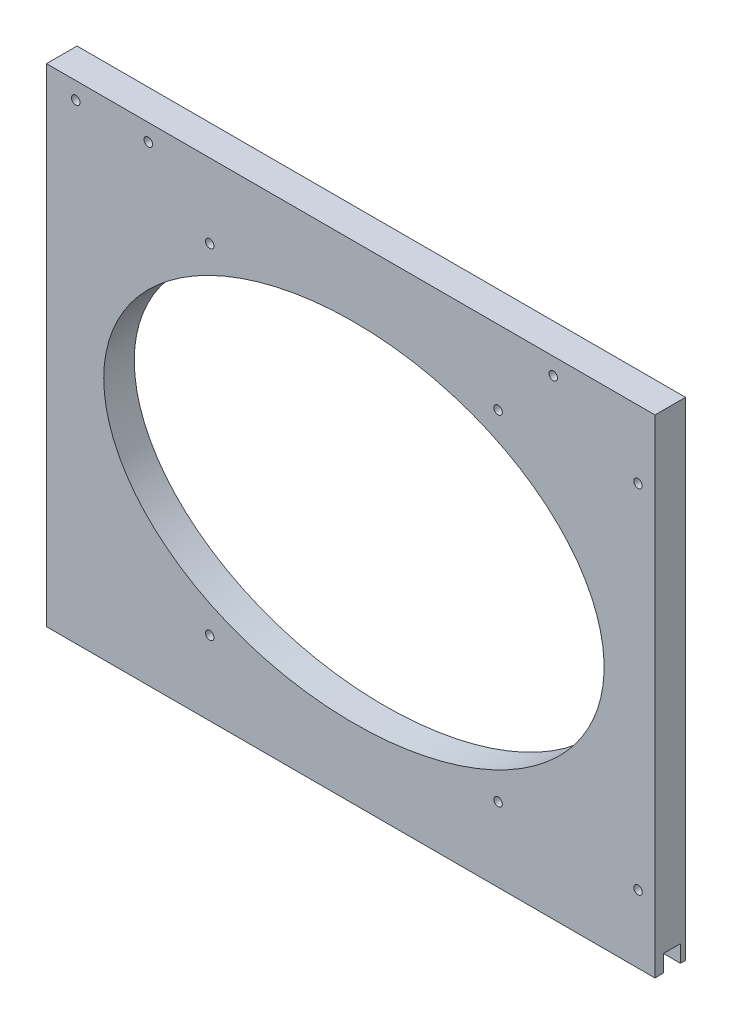
ISO-10303-21;
HEADER;
FILE_DESCRIPTION(('STEP AP214'),'2;1');
FILE_NAME('part.step','',(''),(''),'','','');
FILE_SCHEMA(('AUTOMOTIVE_DESIGN { 1 0 10303 214 1 1 1 1 }'));
ENDSEC;
DATA;
#1=APPLICATION_CONTEXT('core data for automotive mechanical design processes');
#2=APPLICATION_PROTOCOL_DEFINITION('international standard','automotive_design',2000,#1);
#3=PRODUCT_CONTEXT('',#1,'mechanical');
#4=PRODUCT('Part','Part','',(#3));
#5=PRODUCT_RELATED_PRODUCT_CATEGORY('part','',(#4));
#6=PRODUCT_DEFINITION_FORMATION('','',#4);
#7=PRODUCT_DEFINITION_CONTEXT('part definition',#1,'design');
#8=PRODUCT_DEFINITION('design','',#6,#7);
#9=PRODUCT_DEFINITION_SHAPE('','',#8);
#10=(LENGTH_UNIT() NAMED_UNIT(*) SI_UNIT(.MILLI.,.METRE.));
#11=(NAMED_UNIT(*) PLANE_ANGLE_UNIT() SI_UNIT($,.RADIAN.));
#12=(NAMED_UNIT(*) SI_UNIT($,.STERADIAN.) SOLID_ANGLE_UNIT());
#13=UNCERTAINTY_MEASURE_WITH_UNIT(LENGTH_MEASURE(1.E-05),#10,'distance_accuracy_value','');
#14=(GEOMETRIC_REPRESENTATION_CONTEXT(3) GLOBAL_UNCERTAINTY_ASSIGNED_CONTEXT((#13)) GLOBAL_UNIT_ASSIGNED_CONTEXT((#10,
#11,#12)) REPRESENTATION_CONTEXT('',''));
#15=CARTESIAN_POINT('',(0.,0.,0.));
#16=DIRECTION('',(0.,0.,1.));
#17=DIRECTION('',(1.,0.,0.));
#18=AXIS2_PLACEMENT_3D('',#15,#16,#17);
#19=CARTESIAN_POINT('',(-5258.59375,998.5375,-11.43));
#20=DIRECTION('',(0.,-1.,0.));
#21=DIRECTION('',(0.,0.,-1.));
#22=AXIS2_PLACEMENT_3D('',#19,#20,#21);
#23=PLANE('',#22);
#24=DIRECTION('',(1.,0.,0.));
#25=VECTOR('',#24,1.);
#26=CARTESIAN_POINT('',(-5495.38025612107,998.5375,-9.525));
#27=LINE('',#26,#25);
#28=CARTESIAN_POINT('',(-5486.4,998.5375,-9.525));
#29=VERTEX_POINT('',#28);
#30=CARTESIAN_POINT('',(-5258.59375,998.5375,-9.525));
#31=VERTEX_POINT('',#30);
#32=EDGE_CURVE('E134',#29,#31,#27,.T.);
#33=ORIENTED_EDGE('',*,*,#32,.F.);
#34=DIRECTION('',(0.,0.,1.));
#35=VECTOR('',#34,1.);
#36=CARTESIAN_POINT('',(-5486.4,998.5375,-11.43));
#37=LINE('',#36,#35);
#38=CARTESIAN_POINT('',(-5486.4,998.5375,-11.43));
#39=VERTEX_POINT('',#38);
#40=EDGE_CURVE('E123',#39,#29,#37,.T.);
#41=ORIENTED_EDGE('',*,*,#40,.F.);
#42=DIRECTION('',(1.,0.,0.));
#43=VECTOR('',#42,1.);
#44=CARTESIAN_POINT('',(-5258.59375,998.5375,-11.43));
#45=LINE('',#44,#43);
#46=CARTESIAN_POINT('',(-5258.59375,998.5375,-11.43));
#47=VERTEX_POINT('',#46);
#48=EDGE_CURVE('E264',#39,#47,#45,.T.);
#49=ORIENTED_EDGE('',*,*,#48,.T.);
#50=DIRECTION('',(0.,0.,1.));
#51=VECTOR('',#50,1.);
#52=CARTESIAN_POINT('',(-5258.59375,998.5375,-11.43));
#53=LINE('',#52,#51);
#54=EDGE_CURVE('E40',#47,#31,#53,.T.);
#55=ORIENTED_EDGE('',*,*,#54,.T.);
#56=EDGE_LOOP('',(#33,#41,#49,#55));
#57=FACE_BOUND('',#56,.T.);
#58=ADVANCED_FACE('F31',(#57),#23,.T.);
#59=CARTESIAN_POINT('',(-5486.4,1181.1,-11.43));
#60=DIRECTION('',(0.,1.,0.));
#61=DIRECTION('',(0.,0.,1.));
#62=AXIS2_PLACEMENT_3D('',#59,#60,#61);
#63=PLANE('',#62);
#64=DIRECTION('',(-1.,0.,0.));
#65=VECTOR('',#64,1.);
#66=CARTESIAN_POINT('',(-5486.4,1181.1,0.));
#67=LINE('',#66,#65);
#68=CARTESIAN_POINT('',(-5258.59375,1181.1,0.));
#69=VERTEX_POINT('',#68);
#70=CARTESIAN_POINT('',(-5486.4,1181.1,0.));
#71=VERTEX_POINT('',#70);
#72=EDGE_CURVE('E191',#69,#71,#67,.T.);
#73=ORIENTED_EDGE('',*,*,#72,.F.);
#74=DIRECTION('',(0.,0.,1.));
#75=VECTOR('',#74,1.);
#76=CARTESIAN_POINT('',(-5258.59375,1181.1,-11.43));
#77=LINE('',#76,#75);
#78=CARTESIAN_POINT('',(-5258.59375,1181.1,-11.43));
#79=VERTEX_POINT('',#78);
#80=EDGE_CURVE('E11',#79,#69,#77,.T.);
#81=ORIENTED_EDGE('',*,*,#80,.F.);
#82=DIRECTION('',(-1.,0.,0.));
#83=VECTOR('',#82,1.);
#84=CARTESIAN_POINT('',(-5486.4,1181.1,-11.43));
#85=LINE('',#84,#83);
#86=CARTESIAN_POINT('',(-5486.4,1181.1,-11.43));
#87=VERTEX_POINT('',#86);
#88=EDGE_CURVE('E194',#79,#87,#85,.T.);
#89=ORIENTED_EDGE('',*,*,#88,.T.);
#90=DIRECTION('',(0.,0.,1.));
#91=VECTOR('',#90,1.);
#92=CARTESIAN_POINT('',(-5486.4,1181.1,-11.43));
#93=LINE('',#92,#91);
#94=EDGE_CURVE('E35',#87,#71,#93,.T.);
#95=ORIENTED_EDGE('',*,*,#94,.T.);
#96=EDGE_LOOP('',(#73,#81,#89,#95));
#97=FACE_BOUND('',#96,.T.);
#98=ADVANCED_FACE('F33',(#97),#63,.T.);
#99=CARTESIAN_POINT('',(-5258.59375,1181.1,-11.43));
#100=DIRECTION('',(1.,0.,0.));
#101=DIRECTION('',(0.,0.,-1.));
#102=AXIS2_PLACEMENT_3D('',#99,#100,#101);
#103=PLANE('',#102);
#104=DIRECTION('',(0.,1.,0.));
#105=VECTOR('',#104,1.);
#106=CARTESIAN_POINT('',(-5258.59375,1004.8875,-9.525));
#107=LINE('',#106,#105);
#108=CARTESIAN_POINT('',(-5258.59375,1004.8875,-9.525));
#109=VERTEX_POINT('',#108);
#110=EDGE_CURVE('E118',#31,#109,#107,.T.);
#111=ORIENTED_EDGE('',*,*,#110,.F.);
#112=ORIENTED_EDGE('',*,*,#54,.F.);
#113=DIRECTION('',(0.,1.,0.));
#114=VECTOR('',#113,1.);
#115=CARTESIAN_POINT('',(-5258.59375,1181.1,-11.43));
#116=LINE('',#115,#114);
#117=EDGE_CURVE('E261',#47,#79,#116,.T.);
#118=ORIENTED_EDGE('',*,*,#117,.T.);
#119=ORIENTED_EDGE('',*,*,#80,.T.);
#120=DIRECTION('',(0.,1.,0.));
#121=VECTOR('',#120,1.);
#122=CARTESIAN_POINT('',(-5258.59375,1181.1,0.));
#123=LINE('',#122,#121);
#124=CARTESIAN_POINT('',(-5258.59375,998.5375,0.));
#125=VERTEX_POINT('',#124);
#126=EDGE_CURVE('E263',#125,#69,#123,.T.);
#127=ORIENTED_EDGE('',*,*,#126,.F.);
#128=CARTESIAN_POINT('',(-5258.59375,998.5375,-3.175));
#129=VERTEX_POINT('',#128);
#130=EDGE_CURVE('E279',#129,#125,#53,.T.);
#131=ORIENTED_EDGE('',*,*,#130,.F.);
#132=DIRECTION('',(0.,-1.,0.));
#133=VECTOR('',#132,1.);
#134=CARTESIAN_POINT('',(-5258.59375,998.5375,-3.175));
#135=LINE('',#134,#133);
#136=CARTESIAN_POINT('',(-5258.59375,1004.8875,-3.175));
#137=VERTEX_POINT('',#136);
#138=EDGE_CURVE('E124',#137,#129,#135,.T.);
#139=ORIENTED_EDGE('',*,*,#138,.F.);
#140=DIRECTION('',(0.,0.,1.));
#141=VECTOR('',#140,1.);
#142=CARTESIAN_POINT('',(-5258.59375,1004.8875,-3.175));
#143=LINE('',#142,#141);
#144=EDGE_CURVE('E126',#109,#137,#143,.T.);
#145=ORIENTED_EDGE('',*,*,#144,.F.);
#146=EDGE_LOOP('',(#111,#112,#118,#119,#127,#131,#139,#145));
#147=FACE_BOUND('',#146,.T.);
#148=ADVANCED_FACE('F212',(#147),#103,.T.);
#149=DIRECTION('',(1.,0.,0.));
#150=VECTOR('',#149,1.);
#151=CARTESIAN_POINT('',(-5495.38025612107,998.5375,-3.175));
#152=LINE('',#151,#150);
#153=CARTESIAN_POINT('',(-5486.4,998.5375,-3.175));
#154=VERTEX_POINT('',#153);
#155=EDGE_CURVE('E48',#154,#129,#152,.T.);
#156=ORIENTED_EDGE('',*,*,#155,.T.);
#157=ORIENTED_EDGE('',*,*,#130,.T.);
#158=DIRECTION('',(1.,0.,0.));
#159=VECTOR('',#158,1.);
#160=CARTESIAN_POINT('',(-5258.59375,998.5375,0.));
#161=LINE('',#160,#159);
#162=CARTESIAN_POINT('',(-5486.4,998.5375,0.));
#163=VERTEX_POINT('',#162);
#164=EDGE_CURVE('E274',#163,#125,#161,.T.);
#165=ORIENTED_EDGE('',*,*,#164,.F.);
#166=EDGE_CURVE('E266',#154,#163,#37,.T.);
#167=ORIENTED_EDGE('',*,*,#166,.F.);
#168=EDGE_LOOP('',(#156,#157,#165,#167));
#169=FACE_BOUND('',#168,.T.);
#170=ADVANCED_FACE('F215',(#169),#23,.T.);
#171=CARTESIAN_POINT('',(-5486.4,998.5375,-11.43));
#172=DIRECTION('',(-1.,0.,0.));
#173=DIRECTION('',(0.,0.,1.));
#174=AXIS2_PLACEMENT_3D('',#171,#172,#173);
#175=PLANE('',#174);
#176=DIRECTION('',(0.,1.,0.));
#177=VECTOR('',#176,1.);
#178=CARTESIAN_POINT('',(-5486.4,1004.8875,-9.525));
#179=LINE('',#178,#177);
#180=CARTESIAN_POINT('',(-5486.4,1004.8875,-9.525));
#181=VERTEX_POINT('',#180);
#182=EDGE_CURVE('E115',#29,#181,#179,.T.);
#183=ORIENTED_EDGE('',*,*,#182,.T.);
#184=DIRECTION('',(0.,0.,1.));
#185=VECTOR('',#184,1.);
#186=CARTESIAN_POINT('',(-5486.4,1004.8875,-3.175));
#187=LINE('',#186,#185);
#188=CARTESIAN_POINT('',(-5486.4,1004.8875,-3.175));
#189=VERTEX_POINT('',#188);
#190=EDGE_CURVE('E104',#181,#189,#187,.T.);
#191=ORIENTED_EDGE('',*,*,#190,.T.);
#192=DIRECTION('',(0.,-1.,0.));
#193=VECTOR('',#192,1.);
#194=CARTESIAN_POINT('',(-5486.4,998.5375,-3.175));
#195=LINE('',#194,#193);
#196=EDGE_CURVE('E131',#189,#154,#195,.T.);
#197=ORIENTED_EDGE('',*,*,#196,.T.);
#198=ORIENTED_EDGE('',*,*,#166,.T.);
#199=DIRECTION('',(0.,-1.,0.));
#200=VECTOR('',#199,1.);
#201=CARTESIAN_POINT('',(-5486.4,998.5375,0.));
#202=LINE('',#201,#200);
#203=EDGE_CURVE('E271',#71,#163,#202,.T.);
#204=ORIENTED_EDGE('',*,*,#203,.F.);
#205=ORIENTED_EDGE('',*,*,#94,.F.);
#206=DIRECTION('',(0.,-1.,0.));
#207=VECTOR('',#206,1.);
#208=CARTESIAN_POINT('',(-5486.4,998.5375,-11.43));
#209=LINE('',#208,#207);
#210=EDGE_CURVE('E262',#87,#39,#209,.T.);
#211=ORIENTED_EDGE('',*,*,#210,.T.);
#212=ORIENTED_EDGE('',*,*,#40,.T.);
#213=EDGE_LOOP('',(#183,#191,#197,#198,#204,#205,#211,#212));
#214=FACE_BOUND('',#213,.T.);
#215=ADVANCED_FACE('F122',(#214),#175,.T.);
#216=CARTESIAN_POINT('',(-5258.59375,1181.1,-11.43));
#217=DIRECTION('',(0.,0.,-1.));
#218=DIRECTION('',(-1.,0.,0.));
#219=AXIS2_PLACEMENT_3D('',#216,#217,#218);
#220=PLANE('',#219);
#221=CARTESIAN_POINT('',(-5475.43355,1174.75,-11.43));
#222=DIRECTION('',(0.,0.,-1.));
#223=DIRECTION('',(-1.,0.,0.));
#224=AXIS2_PLACEMENT_3D('',#221,#222,#223);
#225=CIRCLE('',#224,1.58750000000045);
#226=CARTESIAN_POINT('',(-5477.02105,1174.75,-11.43));
#227=VERTEX_POINT('',#226);
#228=EDGE_CURVE('E232',#227,#227,#225,.T.);
#229=ORIENTED_EDGE('',*,*,#228,.F.);
#230=EDGE_LOOP('',(#229));
#231=FACE_BOUND('',#230,.T.);
#232=CARTESIAN_POINT('',(-5425.28125,1026.31875,-11.43));
#233=DIRECTION('',(0.,0.,-1.));
#234=DIRECTION('',(-1.,0.,0.));
#235=AXIS2_PLACEMENT_3D('',#232,#233,#234);
#236=CIRCLE('',#235,1.58750000000051);
#237=CARTESIAN_POINT('',(-5426.86875,1026.31875,-11.43));
#238=VERTEX_POINT('',#237);
#239=EDGE_CURVE('E140',#238,#238,#236,.F.);
#240=ORIENTED_EDGE('',*,*,#239,.T.);
#241=EDGE_LOOP('',(#240));
#242=FACE_BOUND('',#241,.T.);
#243=CARTESIAN_POINT('',(-5317.33125,1026.31875,-11.43));
#244=DIRECTION('',(0.,0.,-1.));
#245=DIRECTION('',(-1.,0.,0.));
#246=AXIS2_PLACEMENT_3D('',#243,#244,#245);
#247=CIRCLE('',#246,1.58750000000051);
#248=CARTESIAN_POINT('',(-5318.91875,1026.31875,-11.43));
#249=VERTEX_POINT('',#248);
#250=EDGE_CURVE('E146',#249,#249,#247,.F.);
#251=ORIENTED_EDGE('',*,*,#250,.T.);
#252=EDGE_LOOP('',(#251));
#253=FACE_BOUND('',#252,.T.);
#254=CARTESIAN_POINT('',(-5264.94375,1023.9375,-11.43));
#255=DIRECTION('',(0.,0.,-1.));
#256=DIRECTION('',(-1.,0.,0.));
#257=AXIS2_PLACEMENT_3D('',#254,#255,#256);
#258=CIRCLE('',#257,1.58750000000045);
#259=CARTESIAN_POINT('',(-5266.53125,1023.9375,-11.43));
#260=VERTEX_POINT('',#259);
#261=EDGE_CURVE('E152',#260,#260,#258,.F.);
#262=ORIENTED_EDGE('',*,*,#261,.T.);
#263=EDGE_LOOP('',(#262));
#264=FACE_BOUND('',#263,.T.);
#265=CARTESIAN_POINT('',(-5264.94375,1155.7,-11.43));
#266=DIRECTION('',(0.,0.,-1.));
#267=DIRECTION('',(-1.,0.,0.));
#268=AXIS2_PLACEMENT_3D('',#265,#266,#267);
#269=CIRCLE('',#268,1.58750000000051);
#270=CARTESIAN_POINT('',(-5266.53125,1155.7,-11.43));
#271=VERTEX_POINT('',#270);
#272=EDGE_CURVE('E158',#271,#271,#269,.F.);
#273=ORIENTED_EDGE('',*,*,#272,.T.);
#274=EDGE_LOOP('',(#273));
#275=FACE_BOUND('',#274,.T.);
#276=CARTESIAN_POINT('',(-5317.33125,1153.31875,-11.43));
#277=DIRECTION('',(0.,0.,-1.));
#278=DIRECTION('',(-1.,0.,0.));
#279=AXIS2_PLACEMENT_3D('',#276,#277,#278);
#280=CIRCLE('',#279,1.58750000000051);
#281=CARTESIAN_POINT('',(-5318.91875,1153.31875,-11.43));
#282=VERTEX_POINT('',#281);
#283=EDGE_CURVE('E164',#282,#282,#280,.F.);
#284=ORIENTED_EDGE('',*,*,#283,.T.);
#285=EDGE_LOOP('',(#284));
#286=FACE_BOUND('',#285,.T.);
#287=CARTESIAN_POINT('',(-5296.69375,1174.75,-11.43));
#288=DIRECTION('',(0.,0.,-1.));
#289=DIRECTION('',(-1.,0.,0.));
#290=AXIS2_PLACEMENT_3D('',#287,#288,#289);
#291=CIRCLE('',#290,1.58750000000051);
#292=CARTESIAN_POINT('',(-5298.28125,1174.75,-11.43));
#293=VERTEX_POINT('',#292);
#294=EDGE_CURVE('E170',#293,#293,#291,.F.);
#295=ORIENTED_EDGE('',*,*,#294,.T.);
#296=EDGE_LOOP('',(#295));
#297=FACE_BOUND('',#296,.T.);
#298=CARTESIAN_POINT('',(-5425.28125,1153.31875,-11.43));
#299=DIRECTION('',(0.,0.,-1.));
#300=DIRECTION('',(-1.,0.,0.));
#301=AXIS2_PLACEMENT_3D('',#298,#299,#300);
#302=CIRCLE('',#301,1.5874999999996);
#303=CARTESIAN_POINT('',(-5426.86875,1153.31875,-11.43));
#304=VERTEX_POINT('',#303);
#305=EDGE_CURVE('E176',#304,#304,#302,.F.);
#306=ORIENTED_EDGE('',*,*,#305,.T.);
#307=EDGE_LOOP('',(#306));
#308=FACE_BOUND('',#307,.T.);
#309=CARTESIAN_POINT('',(-5448.3,1174.75,-11.43));
#310=DIRECTION('',(0.,0.,-1.));
#311=DIRECTION('',(-1.,0.,0.));
#312=AXIS2_PLACEMENT_3D('',#309,#310,#311);
#313=CIRCLE('',#312,1.5874999999996);
#314=CARTESIAN_POINT('',(-5449.8875,1174.75,-11.43));
#315=VERTEX_POINT('',#314);
#316=EDGE_CURVE('E182',#315,#315,#313,.F.);
#317=ORIENTED_EDGE('',*,*,#316,.T.);
#318=EDGE_LOOP('',(#317));
#319=FACE_BOUND('',#318,.T.);
#320=CARTESIAN_POINT('',(-5371.30625,1089.81875,-11.43));
#321=DIRECTION('',(0.,0.,1.));
#322=DIRECTION('',(-1.,0.,0.));
#323=AXIS2_PLACEMENT_3D('',#320,#321,#322);
#324=ELLIPSE('',#323,93.6624999999998,65.0874999965074);
#325=CARTESIAN_POINT('',(-5464.96875,1089.81875,-11.43));
#326=VERTEX_POINT('',#325);
#327=EDGE_CURVE('E188',#326,#326,#324,.T.);
#328=ORIENTED_EDGE('',*,*,#327,.T.);
#329=EDGE_LOOP('',(#328));
#330=FACE_BOUND('',#329,.T.);
#331=ORIENTED_EDGE('',*,*,#88,.F.);
#332=ORIENTED_EDGE('',*,*,#117,.F.);
#333=ORIENTED_EDGE('',*,*,#48,.F.);
#334=ORIENTED_EDGE('',*,*,#210,.F.);
#335=EDGE_LOOP('',(#331,#332,#333,#334));
#336=FACE_BOUND('',#335,.T.);
#337=ADVANCED_FACE('F205',(#231,#242,#253,#264,#275,#286,#297,#308,#319,#330,#336),#220,.T.);
#338=CARTESIAN_POINT('',(-5258.59375,1181.1,0.));
#339=DIRECTION('',(0.,0.,-1.));
#340=DIRECTION('',(-1.,0.,0.));
#341=AXIS2_PLACEMENT_3D('',#338,#339,#340);
#342=PLANE('',#341);
#343=CARTESIAN_POINT('',(-5475.43355,1174.75,0.));
#344=DIRECTION('',(0.,0.,-1.));
#345=DIRECTION('',(-1.,0.,0.));
#346=AXIS2_PLACEMENT_3D('',#343,#344,#345);
#347=CIRCLE('',#346,1.58750000000045);
#348=CARTESIAN_POINT('',(-5477.02105,1174.75,0.));
#349=VERTEX_POINT('',#348);
#350=EDGE_CURVE('E230',#349,#349,#347,.F.);
#351=ORIENTED_EDGE('',*,*,#350,.F.);
#352=EDGE_LOOP('',(#351));
#353=FACE_BOUND('',#352,.T.);
#354=CARTESIAN_POINT('',(-5425.28125,1026.31875,0.));
#355=DIRECTION('',(0.,0.,1.));
#356=DIRECTION('',(1.,0.,0.));
#357=AXIS2_PLACEMENT_3D('',#354,#355,#356);
#358=CIRCLE('',#357,1.58750000000051);
#359=CARTESIAN_POINT('',(-5423.69375,1026.31875,0.));
#360=VERTEX_POINT('',#359);
#361=EDGE_CURVE('E137',#360,#360,#358,.T.);
#362=ORIENTED_EDGE('',*,*,#361,.F.);
#363=EDGE_LOOP('',(#362));
#364=FACE_BOUND('',#363,.T.);
#365=CARTESIAN_POINT('',(-5317.33125,1026.31875,0.));
#366=DIRECTION('',(0.,0.,1.));
#367=DIRECTION('',(1.,0.,0.));
#368=AXIS2_PLACEMENT_3D('',#365,#366,#367);
#369=CIRCLE('',#368,1.58750000000051);
#370=CARTESIAN_POINT('',(-5315.74375,1026.31875,0.));
#371=VERTEX_POINT('',#370);
#372=EDGE_CURVE('E143',#371,#371,#369,.T.);
#373=ORIENTED_EDGE('',*,*,#372,.F.);
#374=EDGE_LOOP('',(#373));
#375=FACE_BOUND('',#374,.T.);
#376=CARTESIAN_POINT('',(-5264.94375,1023.9375,0.));
#377=DIRECTION('',(0.,0.,1.));
#378=DIRECTION('',(1.,0.,0.));
#379=AXIS2_PLACEMENT_3D('',#376,#377,#378);
#380=CIRCLE('',#379,1.58750000000045);
#381=CARTESIAN_POINT('',(-5263.35625,1023.9375,0.));
#382=VERTEX_POINT('',#381);
#383=EDGE_CURVE('E149',#382,#382,#380,.T.);
#384=ORIENTED_EDGE('',*,*,#383,.F.);
#385=EDGE_LOOP('',(#384));
#386=FACE_BOUND('',#385,.T.);
#387=CARTESIAN_POINT('',(-5264.94375,1155.7,0.));
#388=DIRECTION('',(0.,0.,1.));
#389=DIRECTION('',(1.,0.,0.));
#390=AXIS2_PLACEMENT_3D('',#387,#388,#389);
#391=CIRCLE('',#390,1.58750000000051);
#392=CARTESIAN_POINT('',(-5263.35625,1155.7,0.));
#393=VERTEX_POINT('',#392);
#394=EDGE_CURVE('E155',#393,#393,#391,.T.);
#395=ORIENTED_EDGE('',*,*,#394,.F.);
#396=EDGE_LOOP('',(#395));
#397=FACE_BOUND('',#396,.T.);
#398=CARTESIAN_POINT('',(-5317.33125,1153.31875,0.));
#399=DIRECTION('',(0.,0.,1.));
#400=DIRECTION('',(1.,0.,0.));
#401=AXIS2_PLACEMENT_3D('',#398,#399,#400);
#402=CIRCLE('',#401,1.58750000000051);
#403=CARTESIAN_POINT('',(-5315.74375,1153.31875,0.));
#404=VERTEX_POINT('',#403);
#405=EDGE_CURVE('E161',#404,#404,#402,.T.);
#406=ORIENTED_EDGE('',*,*,#405,.F.);
#407=EDGE_LOOP('',(#406));
#408=FACE_BOUND('',#407,.T.);
#409=CARTESIAN_POINT('',(-5296.69375,1174.75,0.));
#410=DIRECTION('',(0.,0.,1.));
#411=DIRECTION('',(1.,0.,0.));
#412=AXIS2_PLACEMENT_3D('',#409,#410,#411);
#413=CIRCLE('',#412,1.58750000000051);
#414=CARTESIAN_POINT('',(-5295.10625,1174.75,0.));
#415=VERTEX_POINT('',#414);
#416=EDGE_CURVE('E167',#415,#415,#413,.T.);
#417=ORIENTED_EDGE('',*,*,#416,.F.);
#418=EDGE_LOOP('',(#417));
#419=FACE_BOUND('',#418,.T.);
#420=CARTESIAN_POINT('',(-5425.28125,1153.31875,0.));
#421=DIRECTION('',(0.,0.,1.));
#422=DIRECTION('',(1.,0.,0.));
#423=AXIS2_PLACEMENT_3D('',#420,#421,#422);
#424=CIRCLE('',#423,1.5874999999996);
#425=CARTESIAN_POINT('',(-5423.69375,1153.31875,0.));
#426=VERTEX_POINT('',#425);
#427=EDGE_CURVE('E173',#426,#426,#424,.T.);
#428=ORIENTED_EDGE('',*,*,#427,.F.);
#429=EDGE_LOOP('',(#428));
#430=FACE_BOUND('',#429,.T.);
#431=CARTESIAN_POINT('',(-5448.3,1174.75,0.));
#432=DIRECTION('',(0.,0.,1.));
#433=DIRECTION('',(1.,0.,0.));
#434=AXIS2_PLACEMENT_3D('',#431,#432,#433);
#435=CIRCLE('',#434,1.5874999999996);
#436=CARTESIAN_POINT('',(-5446.7125,1174.75,0.));
#437=VERTEX_POINT('',#436);
#438=EDGE_CURVE('E179',#437,#437,#435,.T.);
#439=ORIENTED_EDGE('',*,*,#438,.F.);
#440=EDGE_LOOP('',(#439));
#441=FACE_BOUND('',#440,.T.);
#442=CARTESIAN_POINT('',(-5371.30625,1089.81875,0.));
#443=DIRECTION('',(0.,0.,1.));
#444=DIRECTION('',(-1.,0.,0.));
#445=AXIS2_PLACEMENT_3D('',#442,#443,#444);
#446=ELLIPSE('',#445,93.6624999999998,65.0874999965074);
#447=CARTESIAN_POINT('',(-5464.96875,1089.81875,0.));
#448=VERTEX_POINT('',#447);
#449=EDGE_CURVE('E185',#448,#448,#446,.T.);
#450=ORIENTED_EDGE('',*,*,#449,.F.);
#451=EDGE_LOOP('',(#450));
#452=FACE_BOUND('',#451,.T.);
#453=ORIENTED_EDGE('',*,*,#72,.T.);
#454=ORIENTED_EDGE('',*,*,#203,.T.);
#455=ORIENTED_EDGE('',*,*,#164,.T.);
#456=ORIENTED_EDGE('',*,*,#126,.T.);
#457=EDGE_LOOP('',(#453,#454,#455,#456));
#458=FACE_BOUND('',#457,.T.);
#459=ADVANCED_FACE('F202',(#353,#364,#375,#386,#397,#408,#419,#430,#441,#452,#458),#342,.F.);
#460=CARTESIAN_POINT('',(-5371.30625,1089.81875,-239.544414818926));
#461=DIRECTION('',(0.,0.,1.));
#462=DIRECTION('',(-1.,0.,0.));
#463=AXIS2_PLACEMENT_3D('',#460,#461,#462);
#464=ELLIPSE('',#463,93.6624999999998,65.0874999965074);
#465=DIRECTION('',(0.,0.,1.));
#466=VECTOR('',#465,1.);
#467=SURFACE_OF_LINEAR_EXTRUSION('',#464,#466);
#468=ORIENTED_EDGE('',*,*,#449,.T.);
#469=EDGE_LOOP('',(#468));
#470=FACE_BOUND('',#469,.T.);
#471=ORIENTED_EDGE('',*,*,#327,.F.);
#472=EDGE_LOOP('',(#471));
#473=FACE_BOUND('',#472,.T.);
#474=ADVANCED_FACE('F197',(#470,#473),#467,.F.);
#475=CARTESIAN_POINT('',(-5448.3,1174.75,-239.544414818926));
#476=DIRECTION('',(0.,0.,1.));
#477=DIRECTION('',(1.,0.,0.));
#478=AXIS2_PLACEMENT_3D('',#475,#476,#477);
#479=CYLINDRICAL_SURFACE('',#478,1.5874999999996);
#480=ORIENTED_EDGE('',*,*,#438,.T.);
#481=EDGE_LOOP('',(#480));
#482=FACE_BOUND('',#481,.T.);
#483=ORIENTED_EDGE('',*,*,#316,.F.);
#484=EDGE_LOOP('',(#483));
#485=FACE_BOUND('',#484,.T.);
#486=ADVANCED_FACE('F201',(#482,#485),#479,.F.);
#487=CARTESIAN_POINT('',(-5425.28125,1153.31875,-239.544414818926));
#488=DIRECTION('',(0.,0.,1.));
#489=DIRECTION('',(1.,0.,0.));
#490=AXIS2_PLACEMENT_3D('',#487,#488,#489);
#491=CYLINDRICAL_SURFACE('',#490,1.5874999999996);
#492=ORIENTED_EDGE('',*,*,#427,.T.);
#493=EDGE_LOOP('',(#492));
#494=FACE_BOUND('',#493,.T.);
#495=ORIENTED_EDGE('',*,*,#305,.F.);
#496=EDGE_LOOP('',(#495));
#497=FACE_BOUND('',#496,.T.);
#498=ADVANCED_FACE('F318',(#494,#497),#491,.F.);
#499=CARTESIAN_POINT('',(-5296.69375,1174.75,-239.544414818926));
#500=DIRECTION('',(0.,0.,1.));
#501=DIRECTION('',(1.,0.,0.));
#502=AXIS2_PLACEMENT_3D('',#499,#500,#501);
#503=CYLINDRICAL_SURFACE('',#502,1.58750000000051);
#504=ORIENTED_EDGE('',*,*,#416,.T.);
#505=EDGE_LOOP('',(#504));
#506=FACE_BOUND('',#505,.T.);
#507=ORIENTED_EDGE('',*,*,#294,.F.);
#508=EDGE_LOOP('',(#507));
#509=FACE_BOUND('',#508,.T.);
#510=ADVANCED_FACE('F315',(#506,#509),#503,.F.);
#511=CARTESIAN_POINT('',(-5317.33125,1153.31875,-239.544414818926));
#512=DIRECTION('',(0.,0.,1.));
#513=DIRECTION('',(1.,0.,0.));
#514=AXIS2_PLACEMENT_3D('',#511,#512,#513);
#515=CYLINDRICAL_SURFACE('',#514,1.58750000000051);
#516=ORIENTED_EDGE('',*,*,#405,.T.);
#517=EDGE_LOOP('',(#516));
#518=FACE_BOUND('',#517,.T.);
#519=ORIENTED_EDGE('',*,*,#283,.F.);
#520=EDGE_LOOP('',(#519));
#521=FACE_BOUND('',#520,.T.);
#522=ADVANCED_FACE('F311',(#518,#521),#515,.F.);
#523=CARTESIAN_POINT('',(-5264.94375,1155.7,-239.544414818926));
#524=DIRECTION('',(0.,0.,1.));
#525=DIRECTION('',(1.,0.,0.));
#526=AXIS2_PLACEMENT_3D('',#523,#524,#525);
#527=CYLINDRICAL_SURFACE('',#526,1.58750000000051);
#528=ORIENTED_EDGE('',*,*,#394,.T.);
#529=EDGE_LOOP('',(#528));
#530=FACE_BOUND('',#529,.T.);
#531=ORIENTED_EDGE('',*,*,#272,.F.);
#532=EDGE_LOOP('',(#531));
#533=FACE_BOUND('',#532,.T.);
#534=ADVANCED_FACE('F307',(#530,#533),#527,.F.);
#535=CARTESIAN_POINT('',(-5264.94375,1023.9375,-239.544414818926));
#536=DIRECTION('',(0.,0.,1.));
#537=DIRECTION('',(1.,0.,0.));
#538=AXIS2_PLACEMENT_3D('',#535,#536,#537);
#539=CYLINDRICAL_SURFACE('',#538,1.58750000000045);
#540=ORIENTED_EDGE('',*,*,#383,.T.);
#541=EDGE_LOOP('',(#540));
#542=FACE_BOUND('',#541,.T.);
#543=ORIENTED_EDGE('',*,*,#261,.F.);
#544=EDGE_LOOP('',(#543));
#545=FACE_BOUND('',#544,.T.);
#546=ADVANCED_FACE('F303',(#542,#545),#539,.F.);
#547=CARTESIAN_POINT('',(-5317.33125,1026.31875,-239.544414818926));
#548=DIRECTION('',(0.,0.,1.));
#549=DIRECTION('',(1.,0.,0.));
#550=AXIS2_PLACEMENT_3D('',#547,#548,#549);
#551=CYLINDRICAL_SURFACE('',#550,1.58750000000051);
#552=ORIENTED_EDGE('',*,*,#372,.T.);
#553=EDGE_LOOP('',(#552));
#554=FACE_BOUND('',#553,.T.);
#555=ORIENTED_EDGE('',*,*,#250,.F.);
#556=EDGE_LOOP('',(#555));
#557=FACE_BOUND('',#556,.T.);
#558=ADVANCED_FACE('F299',(#554,#557),#551,.F.);
#559=CARTESIAN_POINT('',(-5425.28125,1026.31875,-239.544414818926));
#560=DIRECTION('',(0.,0.,1.));
#561=DIRECTION('',(1.,0.,0.));
#562=AXIS2_PLACEMENT_3D('',#559,#560,#561);
#563=CYLINDRICAL_SURFACE('',#562,1.58750000000051);
#564=ORIENTED_EDGE('',*,*,#361,.T.);
#565=EDGE_LOOP('',(#564));
#566=FACE_BOUND('',#565,.T.);
#567=ORIENTED_EDGE('',*,*,#239,.F.);
#568=EDGE_LOOP('',(#567));
#569=FACE_BOUND('',#568,.T.);
#570=ADVANCED_FACE('F296',(#566,#569),#563,.F.);
#571=CARTESIAN_POINT('',(-5495.38025612107,1004.8875,-9.525));
#572=DIRECTION('',(0.,0.,-1.));
#573=DIRECTION('',(-1.,0.,0.));
#574=AXIS2_PLACEMENT_3D('',#571,#572,#573);
#575=PLANE('',#574);
#576=ORIENTED_EDGE('',*,*,#32,.T.);
#577=ORIENTED_EDGE('',*,*,#110,.T.);
#578=DIRECTION('',(1.,0.,0.));
#579=VECTOR('',#578,1.);
#580=CARTESIAN_POINT('',(-5495.38025612107,1004.8875,-9.525));
#581=LINE('',#580,#579);
#582=EDGE_CURVE('E108',#181,#109,#581,.T.);
#583=ORIENTED_EDGE('',*,*,#582,.F.);
#584=ORIENTED_EDGE('',*,*,#182,.F.);
#585=EDGE_LOOP('',(#576,#577,#583,#584));
#586=FACE_BOUND('',#585,.T.);
#587=ADVANCED_FACE('F114',(#586),#575,.F.);
#588=CARTESIAN_POINT('',(-5495.38025612107,1004.8875,-3.175));
#589=DIRECTION('',(0.,1.,0.));
#590=DIRECTION('',(0.,0.,1.));
#591=AXIS2_PLACEMENT_3D('',#588,#589,#590);
#592=PLANE('',#591);
#593=ORIENTED_EDGE('',*,*,#582,.T.);
#594=ORIENTED_EDGE('',*,*,#144,.T.);
#595=DIRECTION('',(1.,0.,0.));
#596=VECTOR('',#595,1.);
#597=CARTESIAN_POINT('',(-5495.38025612107,1004.8875,-3.175));
#598=LINE('',#597,#596);
#599=EDGE_CURVE('E110',#189,#137,#598,.T.);
#600=ORIENTED_EDGE('',*,*,#599,.F.);
#601=ORIENTED_EDGE('',*,*,#190,.F.);
#602=EDGE_LOOP('',(#593,#594,#600,#601));
#603=FACE_BOUND('',#602,.T.);
#604=ADVANCED_FACE('F106',(#603),#592,.F.);
#605=CARTESIAN_POINT('',(-5495.38025612107,998.5375,-3.175));
#606=DIRECTION('',(0.,0.,1.));
#607=DIRECTION('',(1.,0.,0.));
#608=AXIS2_PLACEMENT_3D('',#605,#606,#607);
#609=PLANE('',#608);
#610=ORIENTED_EDGE('',*,*,#599,.T.);
#611=ORIENTED_EDGE('',*,*,#138,.T.);
#612=ORIENTED_EDGE('',*,*,#155,.F.);
#613=ORIENTED_EDGE('',*,*,#196,.F.);
#614=EDGE_LOOP('',(#610,#611,#612,#613));
#615=FACE_BOUND('',#614,.T.);
#616=ADVANCED_FACE('F284',(#615),#609,.F.);
#617=CARTESIAN_POINT('',(-5475.43355,1174.75,4.49012806053573));
#618=DIRECTION('',(0.,0.,-1.));
#619=DIRECTION('',(-1.,0.,0.));
#620=AXIS2_PLACEMENT_3D('',#617,#618,#619);
#621=CYLINDRICAL_SURFACE('',#620,1.58750000000045);
#622=ORIENTED_EDGE('',*,*,#350,.T.);
#623=EDGE_LOOP('',(#622));
#624=FACE_BOUND('',#623,.T.);
#625=ORIENTED_EDGE('',*,*,#228,.T.);
#626=EDGE_LOOP('',(#625));
#627=FACE_BOUND('',#626,.T.);
#628=ADVANCED_FACE('F240',(#624,#627),#621,.F.);
#629=CLOSED_SHELL('',(#58,#98,#148,#170,#215,#337,#459,#474,#486,#498,#510,#522,#534,#546,#558,
#570,#587,#604,#616,#628));
#630=MANIFOLD_SOLID_BREP('B2',#629);
#631=ADVANCED_BREP_SHAPE_REPRESENTATION('',(#18,#630),#14);
#632=SHAPE_DEFINITION_REPRESENTATION(#9,#631);
ENDSEC;
END-ISO-10303-21;
